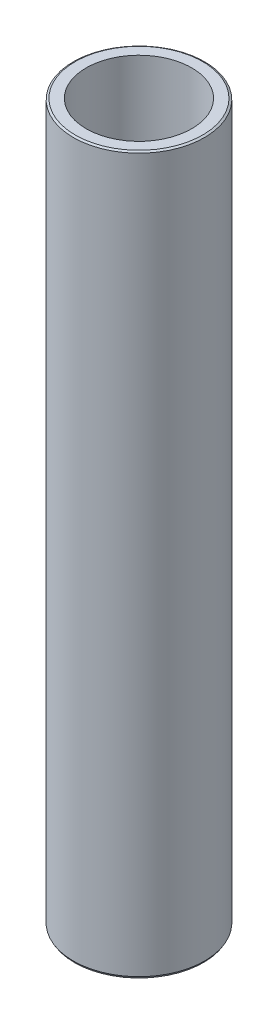
ISO-10303-21;
HEADER;
FILE_DESCRIPTION(('STEP AP214'),'2;1');
FILE_NAME('part.step','',(''),(''),'','','');
FILE_SCHEMA(('AUTOMOTIVE_DESIGN { 1 0 10303 214 1 1 1 1 }'));
ENDSEC;
DATA;
#1=APPLICATION_CONTEXT('core data for automotive mechanical design processes');
#2=APPLICATION_PROTOCOL_DEFINITION('international standard','automotive_design',2000,#1);
#3=PRODUCT_CONTEXT('',#1,'mechanical');
#4=PRODUCT('Part','Part','',(#3));
#5=PRODUCT_RELATED_PRODUCT_CATEGORY('part','',(#4));
#6=PRODUCT_DEFINITION_FORMATION('','',#4);
#7=PRODUCT_DEFINITION_CONTEXT('part definition',#1,'design');
#8=PRODUCT_DEFINITION('design','',#6,#7);
#9=PRODUCT_DEFINITION_SHAPE('','',#8);
#10=(LENGTH_UNIT() NAMED_UNIT(*) SI_UNIT(.MILLI.,.METRE.));
#11=(NAMED_UNIT(*) PLANE_ANGLE_UNIT() SI_UNIT($,.RADIAN.));
#12=(NAMED_UNIT(*) SI_UNIT($,.STERADIAN.) SOLID_ANGLE_UNIT());
#13=UNCERTAINTY_MEASURE_WITH_UNIT(LENGTH_MEASURE(1.E-05),#10,'distance_accuracy_value','');
#14=(GEOMETRIC_REPRESENTATION_CONTEXT(3) GLOBAL_UNCERTAINTY_ASSIGNED_CONTEXT((#13)) GLOBAL_UNIT_ASSIGNED_CONTEXT((#10,
#11,#12)) REPRESENTATION_CONTEXT('',''));
#15=CARTESIAN_POINT('',(0.,0.,0.));
#16=DIRECTION('',(0.,0.,1.));
#17=DIRECTION('',(1.,0.,0.));
#18=AXIS2_PLACEMENT_3D('',#15,#16,#17);
#19=CARTESIAN_POINT('',(0.,600.,0.));
#20=DIRECTION('',(0.,-1.,0.));
#21=DIRECTION('',(0.,0.,-1.));
#22=AXIS2_PLACEMENT_3D('',#19,#20,#21);
#23=CYLINDRICAL_SURFACE('',#22,55.);
#24=CARTESIAN_POINT('',(0.,599.047645782564,0.));
#25=DIRECTION('',(0.,1.,0.));
#26=DIRECTION('',(0.,0.,1.));
#27=AXIS2_PLACEMENT_3D('',#24,#25,#26);
#28=CIRCLE('',#27,55.);
#29=CARTESIAN_POINT('',(0.,599.047645782564,55.));
#30=VERTEX_POINT('',#29);
#31=EDGE_CURVE('E50',#30,#30,#28,.F.);
#32=ORIENTED_EDGE('',*,*,#31,.T.);
#33=EDGE_LOOP('',(#32));
#34=FACE_BOUND('',#33,.T.);
#35=CARTESIAN_POINT('',(0.,1.64952589140244,0.));
#36=DIRECTION('',(0.,1.,0.));
#37=DIRECTION('',(0.,0.,1.));
#38=AXIS2_PLACEMENT_3D('',#35,#36,#37);
#39=CIRCLE('',#38,55.);
#40=CARTESIAN_POINT('',(0.,1.64952589140244,55.));
#41=VERTEX_POINT('',#40);
#42=EDGE_CURVE('E51',#41,#41,#39,.T.);
#43=ORIENTED_EDGE('',*,*,#42,.T.);
#44=EDGE_LOOP('',(#43));
#45=FACE_BOUND('',#44,.T.);
#46=ADVANCED_FACE('F39',(#34,#45),#23,.T.);
#47=CARTESIAN_POINT('',(0.,600.,0.));
#48=DIRECTION('',(0.,1.,0.));
#49=DIRECTION('',(0.,0.,1.));
#50=AXIS2_PLACEMENT_3D('',#47,#48,#49);
#51=PLANE('',#50);
#52=CARTESIAN_POINT('',(0.,600.,0.));
#53=DIRECTION('',(0.,1.,0.));
#54=DIRECTION('',(0.,0.,1.));
#55=AXIS2_PLACEMENT_3D('',#52,#53,#54);
#56=CIRCLE('',#55,53.3504741085977);
#57=CARTESIAN_POINT('',(0.,600.,53.3504741085977));
#58=VERTEX_POINT('',#57);
#59=EDGE_CURVE('E54',#58,#58,#56,.T.);
#60=ORIENTED_EDGE('',*,*,#59,.T.);
#61=EDGE_LOOP('',(#60));
#62=FACE_BOUND('',#61,.T.);
#63=CARTESIAN_POINT('',(0.,600.,0.));
#64=DIRECTION('',(0.,1.,0.));
#65=DIRECTION('',(0.,0.,1.));
#66=AXIS2_PLACEMENT_3D('',#63,#64,#65);
#67=CIRCLE('',#66,44.2155054730696);
#68=CARTESIAN_POINT('',(0.,600.,44.2155054730696));
#69=VERTEX_POINT('',#68);
#70=EDGE_CURVE('E58',#69,#69,#67,.T.);
#71=ORIENTED_EDGE('',*,*,#70,.F.);
#72=EDGE_LOOP('',(#71));
#73=FACE_BOUND('',#72,.T.);
#74=ADVANCED_FACE('F69',(#62,#73),#51,.T.);
#75=CARTESIAN_POINT('',(0.,0.,0.));
#76=DIRECTION('',(0.,1.,0.));
#77=DIRECTION('',(0.,0.,1.));
#78=AXIS2_PLACEMENT_3D('',#75,#76,#77);
#79=PLANE('',#78);
#80=CARTESIAN_POINT('',(0.,0.,0.));
#81=DIRECTION('',(0.,1.,0.));
#82=DIRECTION('',(0.,0.,1.));
#83=AXIS2_PLACEMENT_3D('',#80,#81,#82);
#84=CIRCLE('',#83,54.0476457825635);
#85=CARTESIAN_POINT('',(0.,0.,54.0476457825635));
#86=VERTEX_POINT('',#85);
#87=EDGE_CURVE('E10',#86,#86,#84,.F.);
#88=ORIENTED_EDGE('',*,*,#87,.T.);
#89=EDGE_LOOP('',(#88));
#90=FACE_BOUND('',#89,.T.);
#91=CARTESIAN_POINT('',(0.,0.,0.));
#92=DIRECTION('',(0.,1.,0.));
#93=DIRECTION('',(0.,0.,1.));
#94=AXIS2_PLACEMENT_3D('',#91,#92,#93);
#95=CIRCLE('',#94,44.2155054730696);
#96=CARTESIAN_POINT('',(0.,0.,44.2155054730696));
#97=VERTEX_POINT('',#96);
#98=EDGE_CURVE('E63',#97,#97,#95,.T.);
#99=ORIENTED_EDGE('',*,*,#98,.T.);
#100=EDGE_LOOP('',(#99));
#101=FACE_BOUND('',#100,.T.);
#102=ADVANCED_FACE('F75',(#90,#101),#79,.F.);
#103=CARTESIAN_POINT('',(0.,600.,0.));
#104=DIRECTION('',(0.,-1.,0.));
#105=DIRECTION('',(0.,0.,-1.));
#106=AXIS2_PLACEMENT_3D('',#103,#104,#105);
#107=CYLINDRICAL_SURFACE('',#106,44.2155054730696);
#108=ORIENTED_EDGE('',*,*,#70,.T.);
#109=EDGE_LOOP('',(#108));
#110=FACE_BOUND('',#109,.T.);
#111=ORIENTED_EDGE('',*,*,#98,.F.);
#112=EDGE_LOOP('',(#111));
#113=FACE_BOUND('',#112,.T.);
#114=ADVANCED_FACE('F70',(#110,#113),#107,.F.);
#115=CARTESIAN_POINT('',(0.,600.,0.));
#116=DIRECTION('',(0.,-1.,0.));
#117=DIRECTION('',(0.,0.,-1.));
#118=AXIS2_PLACEMENT_3D('',#115,#116,#117);
#119=CONICAL_SURFACE('',#118,53.3504741085977,1.04719755119661);
#120=ORIENTED_EDGE('',*,*,#31,.F.);
#121=EDGE_LOOP('',(#120));
#122=FACE_BOUND('',#121,.T.);
#123=ORIENTED_EDGE('',*,*,#59,.F.);
#124=EDGE_LOOP('',(#123));
#125=FACE_BOUND('',#124,.T.);
#126=ADVANCED_FACE('F81',(#122,#125),#119,.T.);
#127=CARTESIAN_POINT('',(0.,1.64952589140244,0.));
#128=DIRECTION('',(0.,1.,0.));
#129=DIRECTION('',(0.,0.,1.));
#130=AXIS2_PLACEMENT_3D('',#127,#128,#129);
#131=CONICAL_SURFACE('',#130,55.,0.523598775598324);
#132=ORIENTED_EDGE('',*,*,#87,.F.);
#133=EDGE_LOOP('',(#132));
#134=FACE_BOUND('',#133,.T.);
#135=ORIENTED_EDGE('',*,*,#42,.F.);
#136=EDGE_LOOP('',(#135));
#137=FACE_BOUND('',#136,.T.);
#138=ADVANCED_FACE('F45',(#134,#137),#131,.T.);
#139=CLOSED_SHELL('',(#46,#74,#102,#114,#126,#138));
#140=MANIFOLD_SOLID_BREP('B2',#139);
#141=ADVANCED_BREP_SHAPE_REPRESENTATION('',(#18,#140),#14);
#142=SHAPE_DEFINITION_REPRESENTATION(#9,#141);
ENDSEC;
END-ISO-10303-21;
